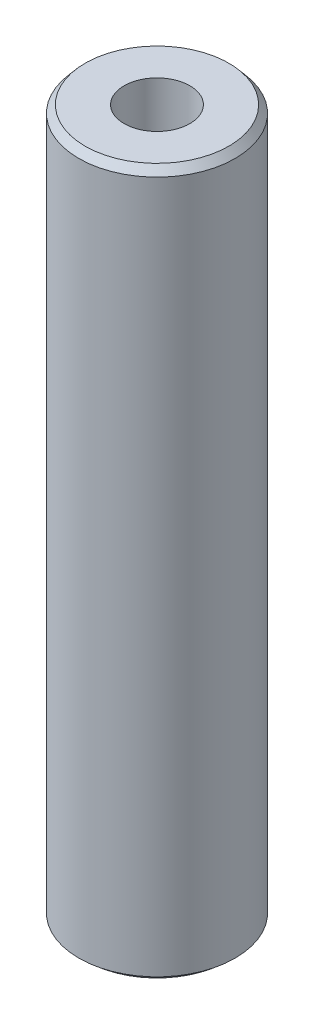
ISO-10303-21;
HEADER;
FILE_DESCRIPTION(('STEP AP214'),'2;1');
FILE_NAME('part.step','',(''),(''),'','','');
FILE_SCHEMA(('AUTOMOTIVE_DESIGN { 1 0 10303 214 1 1 1 1 }'));
ENDSEC;
DATA;
#1=APPLICATION_CONTEXT('core data for automotive mechanical design processes');
#2=APPLICATION_PROTOCOL_DEFINITION('international standard','automotive_design',2000,#1);
#3=PRODUCT_CONTEXT('',#1,'mechanical');
#4=PRODUCT('Part','Part','',(#3));
#5=PRODUCT_RELATED_PRODUCT_CATEGORY('part','',(#4));
#6=PRODUCT_DEFINITION_FORMATION('','',#4);
#7=PRODUCT_DEFINITION_CONTEXT('part definition',#1,'design');
#8=PRODUCT_DEFINITION('design','',#6,#7);
#9=PRODUCT_DEFINITION_SHAPE('','',#8);
#10=(LENGTH_UNIT() NAMED_UNIT(*) SI_UNIT(.MILLI.,.METRE.));
#11=(NAMED_UNIT(*) PLANE_ANGLE_UNIT() SI_UNIT($,.RADIAN.));
#12=(NAMED_UNIT(*) SI_UNIT($,.STERADIAN.) SOLID_ANGLE_UNIT());
#13=UNCERTAINTY_MEASURE_WITH_UNIT(LENGTH_MEASURE(1.E-05),#10,'distance_accuracy_value','');
#14=(GEOMETRIC_REPRESENTATION_CONTEXT(3) GLOBAL_UNCERTAINTY_ASSIGNED_CONTEXT((#13)) GLOBAL_UNIT_ASSIGNED_CONTEXT((#10,
#11,#12)) REPRESENTATION_CONTEXT('',''));
#15=CARTESIAN_POINT('',(0.,0.,0.));
#16=DIRECTION('',(0.,0.,1.));
#17=DIRECTION('',(1.,0.,0.));
#18=AXIS2_PLACEMENT_3D('',#15,#16,#17);
#19=CARTESIAN_POINT('',(0.,67.7420588604201,0.));
#20=DIRECTION('',(0.,-1.,0.));
#21=DIRECTION('',(0.,0.,-1.));
#22=AXIS2_PLACEMENT_3D('',#19,#20,#21);
#23=CYLINDRICAL_SURFACE('',#22,7.5);
#24=CARTESIAN_POINT('',(0.,67.0248208023786,0.));
#25=DIRECTION('',(0.,1.,0.));
#26=DIRECTION('',(0.,0.,1.));
#27=AXIS2_PLACEMENT_3D('',#24,#25,#26);
#28=CIRCLE('',#27,7.5);
#29=CARTESIAN_POINT('',(0.,67.0248208023786,7.5));
#30=VERTEX_POINT('',#29);
#31=EDGE_CURVE('E50',#30,#30,#28,.F.);
#32=ORIENTED_EDGE('',*,*,#31,.T.);
#33=EDGE_LOOP('',(#32));
#34=FACE_BOUND('',#33,.T.);
#35=CARTESIAN_POINT('',(0.,0.606300993581541,0.));
#36=DIRECTION('',(0.,1.,0.));
#37=DIRECTION('',(0.,0.,1.));
#38=AXIS2_PLACEMENT_3D('',#35,#36,#37);
#39=CIRCLE('',#38,7.5);
#40=CARTESIAN_POINT('',(0.,0.606300993581541,7.5));
#41=VERTEX_POINT('',#40);
#42=EDGE_CURVE('E51',#41,#41,#39,.T.);
#43=ORIENTED_EDGE('',*,*,#42,.T.);
#44=EDGE_LOOP('',(#43));
#45=FACE_BOUND('',#44,.T.);
#46=ADVANCED_FACE('F39',(#34,#45),#23,.T.);
#47=CARTESIAN_POINT('',(0.,67.7420588604201,0.));
#48=DIRECTION('',(0.,1.,0.));
#49=DIRECTION('',(0.,0.,1.));
#50=AXIS2_PLACEMENT_3D('',#47,#48,#49);
#51=PLANE('',#50);
#52=CARTESIAN_POINT('',(0.,67.7420588604201,0.));
#53=DIRECTION('',(0.,1.,0.));
#54=DIRECTION('',(0.,0.,1.));
#55=AXIS2_PLACEMENT_3D('',#52,#53,#54);
#56=CIRCLE('',#55,6.89369900641846);
#57=CARTESIAN_POINT('',(0.,67.7420588604201,6.89369900641846));
#58=VERTEX_POINT('',#57);
#59=EDGE_CURVE('E54',#58,#58,#56,.T.);
#60=ORIENTED_EDGE('',*,*,#59,.T.);
#61=EDGE_LOOP('',(#60));
#62=FACE_BOUND('',#61,.T.);
#63=CARTESIAN_POINT('',(0.,67.7420588604201,0.));
#64=DIRECTION('',(0.,1.,0.));
#65=DIRECTION('',(0.,0.,1.));
#66=AXIS2_PLACEMENT_3D('',#63,#64,#65);
#67=CIRCLE('',#66,3.15092549838571);
#68=CARTESIAN_POINT('',(0.,67.7420588604201,3.15092549838571));
#69=VERTEX_POINT('',#68);
#70=EDGE_CURVE('E58',#69,#69,#67,.T.);
#71=ORIENTED_EDGE('',*,*,#70,.F.);
#72=EDGE_LOOP('',(#71));
#73=FACE_BOUND('',#72,.T.);
#74=ADVANCED_FACE('F69',(#62,#73),#51,.T.);
#75=CARTESIAN_POINT('',(0.,0.,0.));
#76=DIRECTION('',(0.,1.,0.));
#77=DIRECTION('',(0.,0.,1.));
#78=AXIS2_PLACEMENT_3D('',#75,#76,#77);
#79=PLANE('',#78);
#80=CARTESIAN_POINT('',(0.,0.,0.));
#81=DIRECTION('',(0.,1.,0.));
#82=DIRECTION('',(0.,0.,1.));
#83=AXIS2_PLACEMENT_3D('',#80,#81,#82);
#84=CIRCLE('',#83,6.7827619419584);
#85=CARTESIAN_POINT('',(0.,0.,6.7827619419584));
#86=VERTEX_POINT('',#85);
#87=EDGE_CURVE('E10',#86,#86,#84,.F.);
#88=ORIENTED_EDGE('',*,*,#87,.T.);
#89=EDGE_LOOP('',(#88));
#90=FACE_BOUND('',#89,.T.);
#91=CARTESIAN_POINT('',(0.,0.,0.));
#92=DIRECTION('',(0.,1.,0.));
#93=DIRECTION('',(0.,0.,1.));
#94=AXIS2_PLACEMENT_3D('',#91,#92,#93);
#95=CIRCLE('',#94,3.15092549838571);
#96=CARTESIAN_POINT('',(0.,0.,3.15092549838571));
#97=VERTEX_POINT('',#96);
#98=EDGE_CURVE('E63',#97,#97,#95,.T.);
#99=ORIENTED_EDGE('',*,*,#98,.T.);
#100=EDGE_LOOP('',(#99));
#101=FACE_BOUND('',#100,.T.);
#102=ADVANCED_FACE('F75',(#90,#101),#79,.F.);
#103=CARTESIAN_POINT('',(0.,67.7420588604201,0.));
#104=DIRECTION('',(0.,-1.,0.));
#105=DIRECTION('',(0.,0.,-1.));
#106=AXIS2_PLACEMENT_3D('',#103,#104,#105);
#107=CYLINDRICAL_SURFACE('',#106,3.15092549838571);
#108=ORIENTED_EDGE('',*,*,#70,.T.);
#109=EDGE_LOOP('',(#108));
#110=FACE_BOUND('',#109,.T.);
#111=ORIENTED_EDGE('',*,*,#98,.F.);
#112=EDGE_LOOP('',(#111));
#113=FACE_BOUND('',#112,.T.);
#114=ADVANCED_FACE('F70',(#110,#113),#107,.F.);
#115=CARTESIAN_POINT('',(0.,67.7420588604201,0.));
#116=DIRECTION('',(0.,-1.,0.));
#117=DIRECTION('',(0.,0.,-1.));
#118=AXIS2_PLACEMENT_3D('',#115,#116,#117);
#119=CONICAL_SURFACE('',#118,6.89369900641846,0.7017751253538);
#120=ORIENTED_EDGE('',*,*,#31,.F.);
#121=EDGE_LOOP('',(#120));
#122=FACE_BOUND('',#121,.T.);
#123=ORIENTED_EDGE('',*,*,#59,.F.);
#124=EDGE_LOOP('',(#123));
#125=FACE_BOUND('',#124,.T.);
#126=ADVANCED_FACE('F81',(#122,#125),#119,.T.);
#127=CARTESIAN_POINT('',(0.,0.606300993581541,0.));
#128=DIRECTION('',(0.,1.,0.));
#129=DIRECTION('',(0.,0.,1.));
#130=AXIS2_PLACEMENT_3D('',#127,#128,#129);
#131=CONICAL_SURFACE('',#130,7.5,0.869021201441098);
#132=ORIENTED_EDGE('',*,*,#87,.F.);
#133=EDGE_LOOP('',(#132));
#134=FACE_BOUND('',#133,.T.);
#135=ORIENTED_EDGE('',*,*,#42,.F.);
#136=EDGE_LOOP('',(#135));
#137=FACE_BOUND('',#136,.T.);
#138=ADVANCED_FACE('F45',(#134,#137),#131,.T.);
#139=CLOSED_SHELL('',(#46,#74,#102,#114,#126,#138));
#140=MANIFOLD_SOLID_BREP('B2',#139);
#141=ADVANCED_BREP_SHAPE_REPRESENTATION('',(#18,#140),#14);
#142=SHAPE_DEFINITION_REPRESENTATION(#9,#141);
ENDSEC;
END-ISO-10303-21;
